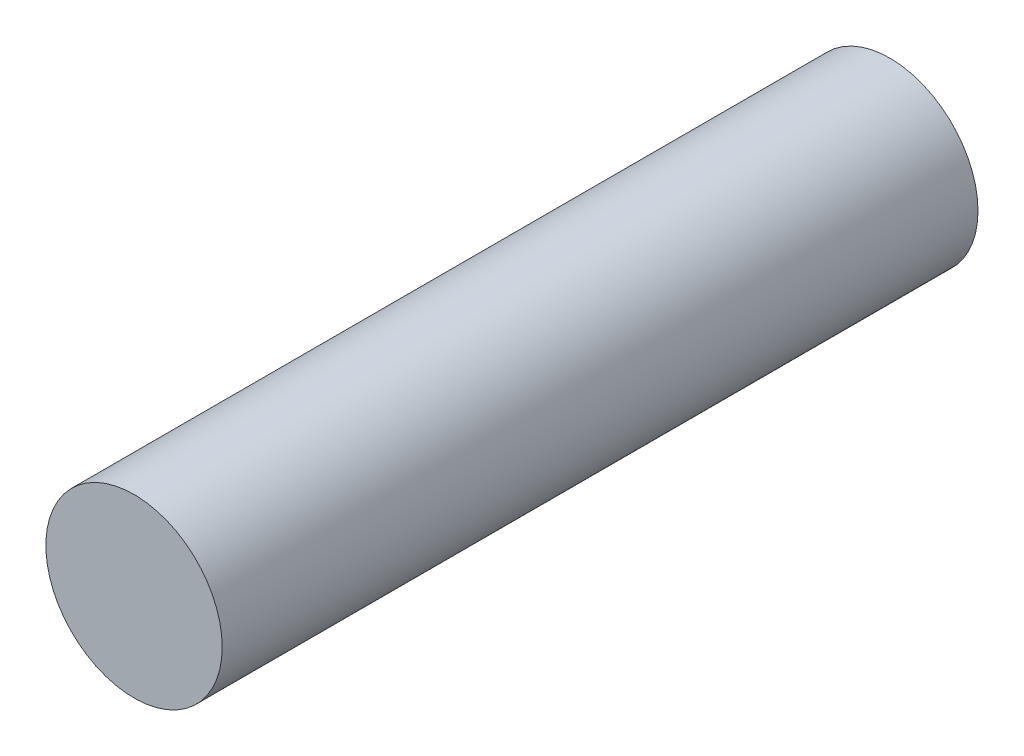
ISO-10303-21;
HEADER;
FILE_DESCRIPTION(('STEP AP214'),'2;1');
FILE_NAME('part.step','',(''),(''),'','','');
FILE_SCHEMA(('AUTOMOTIVE_DESIGN { 1 0 10303 214 1 1 1 1 }'));
ENDSEC;
DATA;
#1=APPLICATION_CONTEXT('core data for automotive mechanical design processes');
#2=APPLICATION_PROTOCOL_DEFINITION('international standard','automotive_design',2000,#1);
#3=PRODUCT_CONTEXT('',#1,'mechanical');
#4=PRODUCT('Part','Part','',(#3));
#5=PRODUCT_RELATED_PRODUCT_CATEGORY('part','',(#4));
#6=PRODUCT_DEFINITION_FORMATION('','',#4);
#7=PRODUCT_DEFINITION_CONTEXT('part definition',#1,'design');
#8=PRODUCT_DEFINITION('design','',#6,#7);
#9=PRODUCT_DEFINITION_SHAPE('','',#8);
#10=(LENGTH_UNIT() NAMED_UNIT(*) SI_UNIT(.MILLI.,.METRE.));
#11=(NAMED_UNIT(*) PLANE_ANGLE_UNIT() SI_UNIT($,.RADIAN.));
#12=(NAMED_UNIT(*) SI_UNIT($,.STERADIAN.) SOLID_ANGLE_UNIT());
#13=UNCERTAINTY_MEASURE_WITH_UNIT(LENGTH_MEASURE(1.E-05),#10,'distance_accuracy_value','');
#14=(GEOMETRIC_REPRESENTATION_CONTEXT(3) GLOBAL_UNCERTAINTY_ASSIGNED_CONTEXT((#13)) GLOBAL_UNIT_ASSIGNED_CONTEXT((#10,
#11,#12)) REPRESENTATION_CONTEXT('',''));
#15=CARTESIAN_POINT('',(0.,0.,0.));
#16=DIRECTION('',(0.,0.,1.));
#17=DIRECTION('',(1.,0.,0.));
#18=AXIS2_PLACEMENT_3D('',#15,#16,#17);
#19=CARTESIAN_POINT('',(0.,20.7,30.));
#20=DIRECTION('',(0.,0.,-1.));
#21=DIRECTION('',(-1.,0.,0.));
#22=AXIS2_PLACEMENT_3D('',#19,#20,#21);
#23=CYLINDRICAL_SURFACE('',#22,3.5);
#24=CARTESIAN_POINT('',(0.,20.7,30.));
#25=DIRECTION('',(0.,0.,1.));
#26=DIRECTION('',(1.,0.,0.));
#27=AXIS2_PLACEMENT_3D('',#24,#25,#26);
#28=CIRCLE('',#27,3.5);
#29=CARTESIAN_POINT('',(3.5,20.7,30.));
#30=VERTEX_POINT('',#29);
#31=EDGE_CURVE('E10',#30,#30,#28,.T.);
#32=ORIENTED_EDGE('',*,*,#31,.F.);
#33=EDGE_LOOP('',(#32));
#34=FACE_BOUND('',#33,.T.);
#35=CARTESIAN_POINT('',(0.,20.7,0.));
#36=DIRECTION('',(0.,0.,1.));
#37=DIRECTION('',(1.,0.,0.));
#38=AXIS2_PLACEMENT_3D('',#35,#36,#37);
#39=CIRCLE('',#38,3.5);
#40=CARTESIAN_POINT('',(3.5,20.7,0.));
#41=VERTEX_POINT('',#40);
#42=EDGE_CURVE('E34',#41,#41,#39,.T.);
#43=ORIENTED_EDGE('',*,*,#42,.T.);
#44=EDGE_LOOP('',(#43));
#45=FACE_BOUND('',#44,.T.);
#46=ADVANCED_FACE('F31',(#34,#45),#23,.T.);
#47=CARTESIAN_POINT('',(0.,20.7,30.));
#48=DIRECTION('',(0.,0.,1.));
#49=DIRECTION('',(1.,0.,0.));
#50=AXIS2_PLACEMENT_3D('',#47,#48,#49);
#51=PLANE('',#50);
#52=ORIENTED_EDGE('',*,*,#31,.T.);
#53=EDGE_LOOP('',(#52));
#54=FACE_BOUND('',#53,.T.);
#55=ADVANCED_FACE('F46',(#54),#51,.T.);
#56=CARTESIAN_POINT('',(0.,20.7,0.));
#57=DIRECTION('',(0.,0.,1.));
#58=DIRECTION('',(1.,0.,0.));
#59=AXIS2_PLACEMENT_3D('',#56,#57,#58);
#60=PLANE('',#59);
#61=ORIENTED_EDGE('',*,*,#42,.F.);
#62=EDGE_LOOP('',(#61));
#63=FACE_BOUND('',#62,.T.);
#64=ADVANCED_FACE('F44',(#63),#60,.F.);
#65=CLOSED_SHELL('',(#46,#55,#64));
#66=MANIFOLD_SOLID_BREP('B2',#65);
#67=ADVANCED_BREP_SHAPE_REPRESENTATION('',(#18,#66),#14);
#68=SHAPE_DEFINITION_REPRESENTATION(#9,#67);
ENDSEC;
END-ISO-10303-21;
